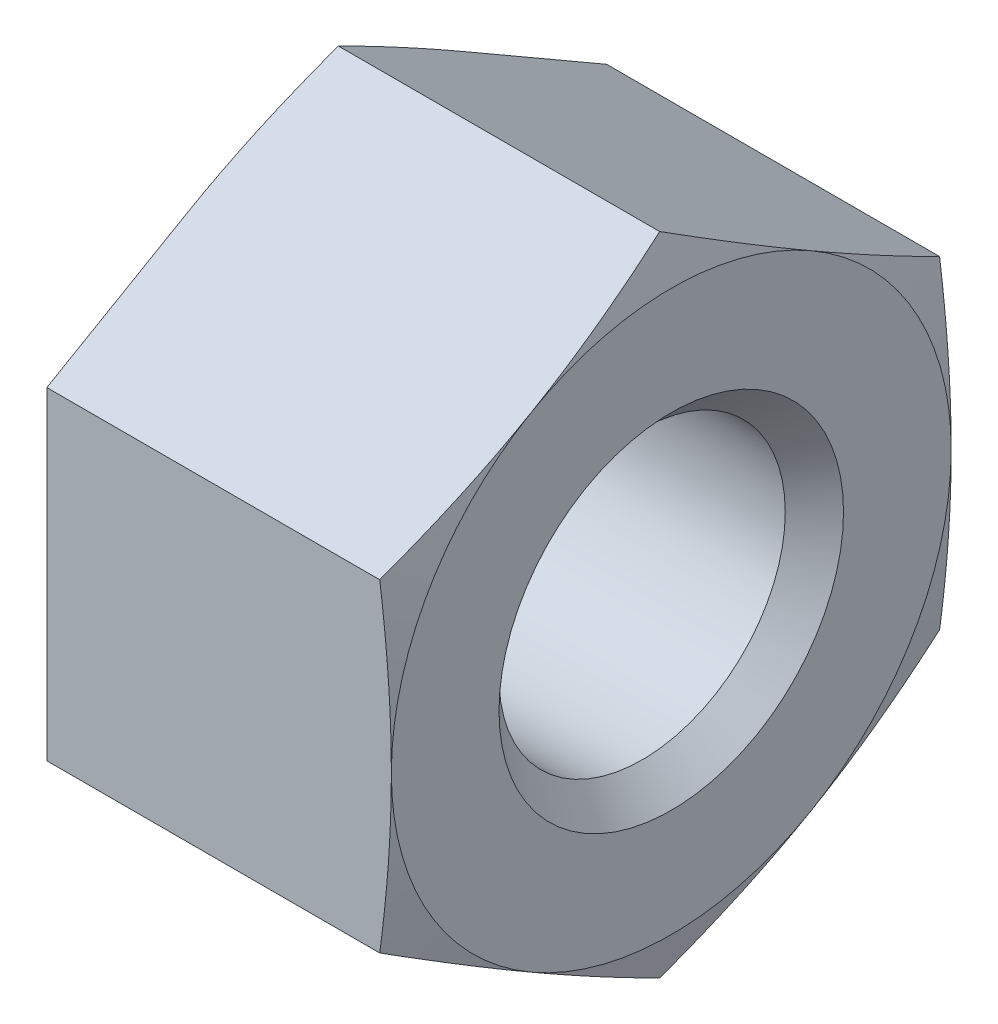
ISO-10303-21;
HEADER;
FILE_DESCRIPTION(('STEP AP214'),'2;1');
FILE_NAME('part.step','',(''),(''),'','','');
FILE_SCHEMA(('AUTOMOTIVE_DESIGN { 1 0 10303 214 1 1 1 1 }'));
ENDSEC;
DATA;
#1=APPLICATION_CONTEXT('core data for automotive mechanical design processes');
#2=APPLICATION_PROTOCOL_DEFINITION('international standard','automotive_design',2000,#1);
#3=PRODUCT_CONTEXT('',#1,'mechanical');
#4=PRODUCT('Part','Part','',(#3));
#5=PRODUCT_RELATED_PRODUCT_CATEGORY('part','',(#4));
#6=PRODUCT_DEFINITION_FORMATION('','',#4);
#7=PRODUCT_DEFINITION_CONTEXT('part definition',#1,'design');
#8=PRODUCT_DEFINITION('design','',#6,#7);
#9=PRODUCT_DEFINITION_SHAPE('','',#8);
#10=(LENGTH_UNIT() NAMED_UNIT(*) SI_UNIT(.MILLI.,.METRE.));
#11=(NAMED_UNIT(*) PLANE_ANGLE_UNIT() SI_UNIT($,.RADIAN.));
#12=(NAMED_UNIT(*) SI_UNIT($,.STERADIAN.) SOLID_ANGLE_UNIT());
#13=UNCERTAINTY_MEASURE_WITH_UNIT(LENGTH_MEASURE(1.E-05),#10,'distance_accuracy_value','');
#14=(GEOMETRIC_REPRESENTATION_CONTEXT(3) GLOBAL_UNCERTAINTY_ASSIGNED_CONTEXT((#13)) GLOBAL_UNIT_ASSIGNED_CONTEXT((#10,
#11,#12)) REPRESENTATION_CONTEXT('',''));
#15=CARTESIAN_POINT('',(0.,0.,0.));
#16=DIRECTION('',(0.,0.,1.));
#17=DIRECTION('',(1.,0.,0.));
#18=AXIS2_PLACEMENT_3D('',#15,#16,#17);
#19=CARTESIAN_POINT('',(0.,5.25,0.));
#20=DIRECTION('',(-1.,0.,0.));
#21=DIRECTION('',(0.,-1.,0.));
#22=AXIS2_PLACEMENT_3D('',#19,#20,#21);
#23=PLANE('',#22);
#24=CARTESIAN_POINT('',(0.,0.,0.));
#25=DIRECTION('',(-1.,0.,0.));
#26=DIRECTION('',(0.,-1.,0.));
#27=AXIS2_PLACEMENT_3D('',#24,#25,#26);
#28=CIRCLE('',#27,3.99999999994044);
#29=CARTESIAN_POINT('',(0.,-3.99999999994044,0.));
#30=VERTEX_POINT('',#29);
#31=EDGE_CURVE('E652',#30,#30,#28,.F.);
#32=ORIENTED_EDGE('',*,*,#31,.T.);
#33=EDGE_LOOP('',(#32));
#34=FACE_BOUND('',#33,.T.);
#35=CARTESIAN_POINT('',(0.,0.,0.));
#36=DIRECTION('',(1.,0.,0.));
#37=DIRECTION('',(0.,1.,0.));
#38=AXIS2_PLACEMENT_3D('',#35,#36,#37);
#39=CIRCLE('',#38,6.5);
#40=CARTESIAN_POINT('',(0.,-5.62916512459885,-3.25));
#41=VERTEX_POINT('',#40);
#42=CARTESIAN_POINT('',(0.,0.,-6.5));
#43=VERTEX_POINT('',#42);
#44=EDGE_CURVE('E382',#41,#43,#39,.T.);
#45=ORIENTED_EDGE('',*,*,#44,.F.);
#46=DIRECTION('',(0.,-0.5,0.866025403784439));
#47=VECTOR('',#46,1.);
#48=CARTESIAN_POINT('',(0.,-3.75277674973257,-6.5));
#49=LINE('',#48,#47);
#50=CARTESIAN_POINT('',(0.,-7.50555349946514,0.));
#51=VERTEX_POINT('',#50);
#52=EDGE_CURVE('E650',#41,#51,#49,.T.);
#53=ORIENTED_EDGE('',*,*,#52,.T.);
#54=DIRECTION('',(0.,0.5,0.866025403784439));
#55=VECTOR('',#54,1.);
#56=CARTESIAN_POINT('',(0.,-7.50555349946513,0.));
#57=LINE('',#56,#55);
#58=CARTESIAN_POINT('',(0.,-3.75277674973257,6.5));
#59=VERTEX_POINT('',#58);
#60=EDGE_CURVE('E61',#51,#59,#57,.T.);
#61=ORIENTED_EDGE('',*,*,#60,.T.);
#62=DIRECTION('',(0.,1.,0.));
#63=VECTOR('',#62,1.);
#64=CARTESIAN_POINT('',(0.,-3.75277674973257,6.5));
#65=LINE('',#64,#63);
#66=CARTESIAN_POINT('',(0.,3.75277674973257,6.5));
#67=VERTEX_POINT('',#66);
#68=EDGE_CURVE('E318',#59,#67,#65,.T.);
#69=ORIENTED_EDGE('',*,*,#68,.T.);
#70=DIRECTION('',(0.,-0.5,0.866025403784439));
#71=VECTOR('',#70,1.);
#72=CARTESIAN_POINT('',(0.,6.94166512459885,0.976683315065849));
#73=LINE('',#72,#71);
#74=CARTESIAN_POINT('',(0.,5.62916512459885,3.25));
#75=VERTEX_POINT('',#74);
#76=EDGE_CURVE('E643',#75,#67,#73,.T.);
#77=ORIENTED_EDGE('',*,*,#76,.F.);
#78=CARTESIAN_POINT('',(0.,0.,0.));
#79=DIRECTION('',(1.,0.,0.));
#80=DIRECTION('',(0.,1.,0.));
#81=AXIS2_PLACEMENT_3D('',#78,#79,#80);
#82=CIRCLE('',#81,6.5);
#83=CARTESIAN_POINT('',(0.,5.62916512459885,-3.25));
#84=VERTEX_POINT('',#83);
#85=EDGE_CURVE('E387',#84,#75,#82,.T.);
#86=ORIENTED_EDGE('',*,*,#85,.F.);
#87=DIRECTION('',(0.,-0.5,-0.866025403784439));
#88=VECTOR('',#87,1.);
#89=CARTESIAN_POINT('',(0.,7.50555349946513,0.));
#90=LINE('',#89,#88);
#91=CARTESIAN_POINT('',(0.,3.75277674973257,-6.5));
#92=VERTEX_POINT('',#91);
#93=EDGE_CURVE('E637',#84,#92,#90,.T.);
#94=ORIENTED_EDGE('',*,*,#93,.T.);
#95=DIRECTION('',(0.,1.,0.));
#96=VECTOR('',#95,1.);
#97=CARTESIAN_POINT('',(0.,5.25,-6.5));
#98=LINE('',#97,#96);
#99=EDGE_CURVE('E135',#43,#92,#98,.T.);
#100=ORIENTED_EDGE('',*,*,#99,.F.);
#101=EDGE_LOOP('',(#45,#53,#61,#69,#77,#86,#94,#100));
#102=FACE_BOUND('',#101,.T.);
#103=ADVANCED_FACE('F46',(#34,#102),#23,.T.);
#104=CARTESIAN_POINT('',(0.271053871616739,0.,0.));
#105=DIRECTION('',(1.,0.,0.));
#106=DIRECTION('',(0.,1.,0.));
#107=AXIS2_PLACEMENT_3D('',#104,#105,#106);
#108=CONICAL_SURFACE('',#107,7.51158682046192,1.30899693899575);
#109=ORIENTED_EDGE('',*,*,#44,.T.);
#110=CARTESIAN_POINT('',(0.,0.,-6.5));
#111=CARTESIAN_POINT('',(-7.13979565578263E-06,-0.157002105596348,-6.5));
#112=CARTESIAN_POINT('',(0.00152486973365407,-0.31399978962663,-6.5));
#113=CARTESIAN_POINT('',(0.00760677423425841,-0.627931829437165,-6.5));
#114=CARTESIAN_POINT('',(0.0121565721115602,-0.784866187092334,-6.5));
#115=CARTESIAN_POINT('',(0.0302281250175524,-1.2551418189265,-6.5));
#116=CARTESIAN_POINT('',(0.0481723122569531,-1.56832203806185,-6.5));
#117=CARTESIAN_POINT('',(0.094756857160038,-2.19378211713768,-6.5));
#118=CARTESIAN_POINT('',(0.123394692466353,-2.50606217191345,-6.5));
#119=CARTESIAN_POINT('',(0.189882514217087,-3.1300072751411,-6.5));
#120=CARTESIAN_POINT('',(0.227742957297204,-3.44167121780682,-6.5));
#121=CARTESIAN_POINT('',(0.269437248127971,-3.75277674973257,-6.5));
#122=B_SPLINE_CURVE_WITH_KNOTS('',3,(#110,#111,#112,#113,#114,#115,#116,#117,#118,#119,#120,
#121),.UNSPECIFIED.,.F.,.F.,(4,2,2,2,2,4),(0.,0.470990466283024,0.941965779705234,
1.88281797607381,2.82344838957464,3.76515029917374),.UNSPECIFIED.);
#123=CARTESIAN_POINT('',(0.269437248127971,-3.75277674973257,-6.5));
#124=VERTEX_POINT('',#123);
#125=EDGE_CURVE('E140',#43,#124,#122,.T.);
#126=ORIENTED_EDGE('',*,*,#125,.T.);
#127=CARTESIAN_POINT('',(0.269437248127971,-3.75277674973257,-6.5));
#128=CARTESIAN_POINT('',(0.227742957297204,-3.90832951569544,-6.23057470609444));
#129=CARTESIAN_POINT('',(0.189882514217087,-4.0641614870283,-5.9606658143023));
#130=CARTESIAN_POINT('',(0.123394692466353,-4.37613403864213,-5.42031350434025));
#131=CARTESIAN_POINT('',(0.0947568571600377,-4.53227406603001,-5.14987104380924));
#132=CARTESIAN_POINT('',(0.0481723122569529,-4.84500410556793,-4.60820672627655));
#133=CARTESIAN_POINT('',(0.0302281250175522,-5.0015942151356,-4.33698470054256));
#134=CARTESIAN_POINT('',(0.0121565721115598,-5.23673203105269,-3.92971405659339));
#135=CARTESIAN_POINT('',(0.00760677423425789,-5.31519920988027,-3.79380491613742));
#136=CARTESIAN_POINT('',(0.0015248697336535,-5.47216522978554,-3.52193179459963));
#137=CARTESIAN_POINT('',(-7.13979565629992E-06,-5.55066407180068,-3.38596781189408));
#138=CARTESIAN_POINT('',(0.,-5.62916512459885,-3.25));
#139=B_SPLINE_CURVE_WITH_KNOTS('',3,(#127,#128,#129,#130,#131,#132,#133,#134,#135,#136,#137,
#138),.UNSPECIFIED.,.F.,.F.,(4,2,2,2,2,4),(0.,0.941701909599103,1.88233232309993,
2.82318451946851,3.29415983289072,3.76515029917374),.UNSPECIFIED.);
#140=EDGE_CURVE('E250',#124,#41,#139,.T.);
#141=ORIENTED_EDGE('',*,*,#140,.T.);
#142=EDGE_LOOP('',(#109,#126,#141));
#143=FACE_BOUND('',#142,.T.);
#144=ADVANCED_FACE('F278',(#143),#108,.T.);
#145=CARTESIAN_POINT('',(0.271053871616739,0.,0.));
#146=DIRECTION('',(1.,0.,0.));
#147=DIRECTION('',(0.,1.,0.));
#148=AXIS2_PLACEMENT_3D('',#145,#146,#147);
#149=CONICAL_SURFACE('',#148,7.51158682046193,1.30899693899575);
#150=CARTESIAN_POINT('',(0.269437248127972,7.50555349946513,0.));
#151=CARTESIAN_POINT('',(0.227742957297205,7.35000073350226,-0.269425293905566));
#152=CARTESIAN_POINT('',(0.189882514217088,7.1941687621694,-0.539334185697703));
#153=CARTESIAN_POINT('',(0.123394692466353,6.88219621055557,-1.07968649565975));
#154=CARTESIAN_POINT('',(0.094756857160038,6.72605618316769,-1.35012895619077));
#155=CARTESIAN_POINT('',(0.0481723122569529,6.41332614362978,-1.89179327372345));
#156=CARTESIAN_POINT('',(0.0302281250175521,6.2567360340621,-2.16301529945744));
#157=CARTESIAN_POINT('',(0.0121565721115598,6.02159821814502,-2.57028594340661));
#158=CARTESIAN_POINT('',(0.00760677423425809,5.94313103931743,-2.70619508386258));
#159=CARTESIAN_POINT('',(0.00152486973365381,5.78616501941216,-2.97806820540037));
#160=CARTESIAN_POINT('',(-7.13979565599147E-06,5.70766617739702,-3.11403218810592));
#161=CARTESIAN_POINT('',(0.,5.62916512459885,-3.25));
#162=B_SPLINE_CURVE_WITH_KNOTS('',3,(#150,#151,#152,#153,#154,#155,#156,#157,#158,#159,#160,
#161),.UNSPECIFIED.,.F.,.F.,(4,2,2,2,2,4),(0.,0.941701909599103,1.88233232309993,
2.82318451946851,3.29415983289072,3.76515029917374),.UNSPECIFIED.);
#163=CARTESIAN_POINT('',(0.269437248127972,7.50555349946514,0.));
#164=VERTEX_POINT('',#163);
#165=EDGE_CURVE('E402',#164,#84,#162,.T.);
#166=ORIENTED_EDGE('',*,*,#165,.T.);
#167=ORIENTED_EDGE('',*,*,#85,.T.);
#168=CARTESIAN_POINT('',(0.,5.62916512459885,3.25));
#169=CARTESIAN_POINT('',(-7.13979565564765E-06,5.70766617739702,3.11403218810592));
#170=CARTESIAN_POINT('',(0.00152486973365415,5.78616501941217,2.97806820540037));
#171=CARTESIAN_POINT('',(0.00760677423425843,5.94313103931743,2.70619508386258));
#172=CARTESIAN_POINT('',(0.0121565721115602,6.02159821814502,2.57028594340661));
#173=CARTESIAN_POINT('',(0.0302281250175525,6.2567360340621,2.16301529945744));
#174=CARTESIAN_POINT('',(0.0481723122569534,6.41332614362978,1.89179327372345));
#175=CARTESIAN_POINT('',(0.0947568571600384,6.72605618316769,1.35012895619076));
#176=CARTESIAN_POINT('',(0.123394692466353,6.88219621055557,1.07968649565975));
#177=CARTESIAN_POINT('',(0.189882514217088,7.1941687621694,0.539334185697702));
#178=CARTESIAN_POINT('',(0.227742957297205,7.35000073350226,0.269425293905565));
#179=CARTESIAN_POINT('',(0.269437248127972,7.50555349946514,0.));
#180=B_SPLINE_CURVE_WITH_KNOTS('',3,(#168,#169,#170,#171,#172,#173,#174,#175,#176,#177,#178,
#179),.UNSPECIFIED.,.F.,.F.,(4,2,2,2,2,4),(0.,0.470990466283024,0.941965779705235,
1.88281797607382,2.82344838957464,3.76515029917374),.UNSPECIFIED.);
#181=EDGE_CURVE('E269',#75,#164,#180,.T.);
#182=ORIENTED_EDGE('',*,*,#181,.T.);
#183=EDGE_LOOP('',(#166,#167,#182));
#184=FACE_BOUND('',#183,.T.);
#185=ADVANCED_FACE('F282',(#184),#149,.T.);
#186=CARTESIAN_POINT('',(9.,3.75277674973257,6.5));
#187=DIRECTION('',(0.,-0.866025403784439,-0.5));
#188=DIRECTION('',(0.,0.5,-0.866025403784439));
#189=AXIS2_PLACEMENT_3D('',#186,#187,#188);
#190=PLANE('',#189);
#191=DIRECTION('',(-1.,0.,0.));
#192=VECTOR('',#191,1.);
#193=CARTESIAN_POINT('',(9.,3.75277674973257,6.5));
#194=LINE('',#193,#192);
#195=CARTESIAN_POINT('',(7.73056274880662,3.75277677261311,6.5));
#196=VERTEX_POINT('',#195);
#197=EDGE_CURVE('E461',#67,#196,#194,.F.);
#198=ORIENTED_EDGE('',*,*,#197,.T.);
#199=CARTESIAN_POINT('',(8.,5.62916512459885,3.25));
#200=CARTESIAN_POINT('',(8.00000713979493,5.55066407383612,3.38596780836859));
#201=CARTESIAN_POINT('',(7.99847513034546,5.47216523385625,3.52193178754894));
#202=CARTESIAN_POINT('',(7.99239322615947,5.31519921801895,3.79380490204081));
#203=CARTESIAN_POINT('',(7.98784342851693,5.23673204122406,3.92971403897604));
#204=CARTESIAN_POINT('',(7.96977187653705,5.00159423138714,4.33698467239407));
#205=CARTESIAN_POINT('',(7.95182769021088,4.84500412586075,4.60820669112834));
#206=CARTESIAN_POINT('',(7.90524314761743,4.53227409437238,5.14987099471882));
#207=CARTESIAN_POINT('',(7.87660531370721,4.37613407099275,5.42031344830733));
#208=CARTESIAN_POINT('',(7.81011749510641,4.06416152737775,5.96066574441501));
#209=CARTESIAN_POINT('',(7.77225705378095,3.90832956003539,6.23057462929539));
#210=CARTESIAN_POINT('',(7.73056276481819,3.75277679804829,6.49999991631471));
#211=B_SPLINE_CURVE_WITH_KNOTS('',3,(#199,#200,#201,#202,#203,#204,#205,#206,#207,#208,#209,
#210),.UNSPECIFIED.,.F.,.F.,(4,2,2,2,2,4),(0.,0.470990454071578,0.941965755284311,
1.88281792730448,2.82344831648137,3.76515020168719),.UNSPECIFIED.);
#212=CARTESIAN_POINT('',(8.,5.62916512459885,3.25));
#213=VERTEX_POINT('',#212);
#214=EDGE_CURVE('E340',#213,#196,#211,.T.);
#215=ORIENTED_EDGE('',*,*,#214,.F.);
#216=CARTESIAN_POINT('',(7.73056274574151,7.50555352234456,-3.96283249653615E-08));
#217=CARTESIAN_POINT('',(7.77225703745685,7.350000754499,0.269425257538153));
#218=CARTESIAN_POINT('',(7.81011748136786,7.19416878127647,0.539334152603284));
#219=CARTESIAN_POINT('',(7.87660530461022,6.88219622587488,1.07968646912593));
#220=CARTESIAN_POINT('',(7.90524314057764,6.72605619658893,1.35012893294449));
#221=CARTESIAN_POINT('',(7.95182768657443,6.41332615323924,1.89179325707937));
#222=CARTESIAN_POINT('',(7.96977187424628,6.25673604175786,2.16301528612801));
#223=CARTESIAN_POINT('',(7.98784342759083,6.02159822296157,2.57028593506409));
#224=CARTESIAN_POINT('',(7.9923932255793,5.94313104317142,2.70619507718727));
#225=CARTESIAN_POINT('',(7.99847513022888,5.78616502133981,2.97806820206159));
#226=CARTESIAN_POINT('',(8.000007139796,5.70766617836089,3.11403218643645));
#227=CARTESIAN_POINT('',(8.,5.62916512459885,3.25));
#228=B_SPLINE_CURVE_WITH_KNOTS('',3,(#216,#217,#218,#219,#220,#221,#222,#223,#224,#225,#226,
#227),.UNSPECIFIED.,.F.,.F.,(4,2,2,2,2,4),(0.,0.941701921150293,1.88233234616947,2.823184554068,
3.29415987327188,3.76515034533751),.UNSPECIFIED.);
#229=CARTESIAN_POINT('',(7.73056274880677,7.50555351090485,-1.98141624286739E-08));
#230=VERTEX_POINT('',#229);
#231=EDGE_CURVE('E336',#230,#213,#228,.T.);
#232=ORIENTED_EDGE('',*,*,#231,.F.);
#233=DIRECTION('',(1.,0.,0.));
#234=VECTOR('',#233,1.);
#235=CARTESIAN_POINT('',(9.,7.50555349946513,0.));
#236=LINE('',#235,#234);
#237=EDGE_CURVE('E139',#230,#164,#236,.F.);
#238=ORIENTED_EDGE('',*,*,#237,.T.);
#239=ORIENTED_EDGE('',*,*,#181,.F.);
#240=ORIENTED_EDGE('',*,*,#76,.T.);
#241=EDGE_LOOP('',(#198,#215,#232,#238,#239,#240));
#242=FACE_BOUND('',#241,.T.);
#243=ADVANCED_FACE('F439',(#242),#190,.F.);
#244=CARTESIAN_POINT('',(9.,-3.75277674973257,6.5));
#245=DIRECTION('',(0.,0.,-1.));
#246=DIRECTION('',(-1.,0.,0.));
#247=AXIS2_PLACEMENT_3D('',#244,#245,#246);
#248=PLANE('',#247);
#249=DIRECTION('',(1.,0.,0.));
#250=VECTOR('',#249,1.);
#251=CARTESIAN_POINT('',(9.,-3.75277674973257,6.5));
#252=LINE('',#251,#250);
#253=CARTESIAN_POINT('',(7.7305627583451,-3.75277677389042,6.49999995815736));
#254=VERTEX_POINT('',#253);
#255=EDGE_CURVE('E66',#59,#254,#252,.T.);
#256=ORIENTED_EDGE('',*,*,#255,.T.);
#257=CARTESIAN_POINT('',(8.,0.,6.5));
#258=CARTESIAN_POINT('',(8.000007139796,-0.157002107524173,6.5));
#259=CARTESIAN_POINT('',(7.99847513022888,-0.313999793482112,6.5));
#260=CARTESIAN_POINT('',(7.99239322557928,-0.627931837145524,6.5));
#261=CARTESIAN_POINT('',(7.98784342759081,-0.784866196725914,6.5));
#262=CARTESIAN_POINT('',(7.96977187424624,-1.25514183431876,6.5));
#263=CARTESIAN_POINT('',(7.95182768657438,-1.56832205728172,6.5));
#264=CARTESIAN_POINT('',(7.90524314057753,-2.19378214398147,6.5));
#265=CARTESIAN_POINT('',(7.87660530461008,-2.50606220255356,6.5));
#266=CARTESIAN_POINT('',(7.81011748136765,-3.1300073133571,6.5));
#267=CARTESIAN_POINT('',(7.77225703745659,-3.44167125980234,6.5));
#268=CARTESIAN_POINT('',(7.7305627457412,-3.75277679549365,6.5));
#269=B_SPLINE_CURVE_WITH_KNOTS('',3,(#257,#258,#259,#260,#261,#262,#263,#264,#265,#266,#267,
#268),.UNSPECIFIED.,.F.,.F.,(4,2,2,2,2,4),(0.,0.470990472065913,0.94196579127008,
1.88281799916917,2.82344842418891,3.76515034533976),.UNSPECIFIED.);
#270=CARTESIAN_POINT('',(8.,0.,6.5));
#271=VERTEX_POINT('',#270);
#272=EDGE_CURVE('E233',#271,#254,#269,.T.);
#273=ORIENTED_EDGE('',*,*,#272,.F.);
#274=CARTESIAN_POINT('',(7.7305627457412,3.75277679549366,6.5));
#275=CARTESIAN_POINT('',(7.77225703745659,3.44167125980235,6.5));
#276=CARTESIAN_POINT('',(7.81011748136765,3.13000731335711,6.5));
#277=CARTESIAN_POINT('',(7.87660530461008,2.50606220255357,6.5));
#278=CARTESIAN_POINT('',(7.90524314057753,2.19378214398147,6.5));
#279=CARTESIAN_POINT('',(7.95182768657437,1.56832205728172,6.5));
#280=CARTESIAN_POINT('',(7.96977187424624,1.25514183431876,6.5));
#281=CARTESIAN_POINT('',(7.98784342759081,0.784866196725916,6.5));
#282=CARTESIAN_POINT('',(7.99239322557929,0.627931837145525,6.5));
#283=CARTESIAN_POINT('',(7.99847513022888,0.313999793482112,6.5));
#284=CARTESIAN_POINT('',(8.000007139796,0.157002107524173,6.5));
#285=CARTESIAN_POINT('',(8.,0.,6.5));
#286=B_SPLINE_CURVE_WITH_KNOTS('',3,(#274,#275,#276,#277,#278,#279,#280,#281,#282,#283,#284,
#285),.UNSPECIFIED.,.F.,.F.,(4,2,2,2,2,4),(0.,0.941701921150859,1.8823323461706,
2.82318455406969,3.29415987327386,3.76515034533978),.UNSPECIFIED.);
#287=EDGE_CURVE('E347',#196,#271,#286,.T.);
#288=ORIENTED_EDGE('',*,*,#287,.F.);
#289=ORIENTED_EDGE('',*,*,#197,.F.);
#290=ORIENTED_EDGE('',*,*,#68,.F.);
#291=EDGE_LOOP('',(#256,#273,#288,#289,#290));
#292=FACE_BOUND('',#291,.T.);
#293=ADVANCED_FACE('F442',(#292),#248,.F.);
#294=CARTESIAN_POINT('',(9.,-7.50555349946513,0.));
#295=DIRECTION('',(0.,0.866025403784439,-0.5));
#296=DIRECTION('',(0.,0.5,0.866025403784439));
#297=AXIS2_PLACEMENT_3D('',#294,#295,#296);
#298=PLANE('',#297);
#299=DIRECTION('',(1.,0.,0.));
#300=VECTOR('',#299,1.);
#301=CARTESIAN_POINT('',(9.,-7.50555349946514,0.));
#302=LINE('',#301,#300);
#303=CARTESIAN_POINT('',(7.73056275357586,-7.50555349310634,-1.10137529284157E-08));
#304=VERTEX_POINT('',#303);
#305=EDGE_CURVE('E262',#51,#304,#302,.T.);
#306=ORIENTED_EDGE('',*,*,#305,.T.);
#307=CARTESIAN_POINT('',(8.,-5.62916512459885,3.25));
#308=CARTESIAN_POINT('',(8.00000713979546,-5.70766617686126,3.11403218903389));
#309=CARTESIAN_POINT('',(7.99847513028717,-5.78616501834068,2.97806820725624));
#310=CARTESIAN_POINT('',(7.99239322586938,-5.94313103717518,2.70619508757306));
#311=CARTESIAN_POINT('',(7.98784342805387,-6.02159821546772,2.57028594804382));
#312=CARTESIAN_POINT('',(7.96977187539165,-6.2567360297844,2.16301530686664));
#313=CARTESIAN_POINT('',(7.95182768839262,-6.41332613828833,1.8917932829751));
#314=CARTESIAN_POINT('',(7.90524314409748,-6.72605617570746,1.35012896911226));
#315=CARTESIAN_POINT('',(7.87660530915864,-6.8821962020403,1.07968651040864));
#316=CARTESIAN_POINT('',(7.81011748823703,-7.19416875154868,0.539334204093319));
#317=CARTESIAN_POINT('',(7.77225704561877,-7.35000072183117,0.269425314120484));
#318=CARTESIAN_POINT('',(7.73056275527969,-7.50555348674755,2.20275055806718E-08));
#319=B_SPLINE_CURVE_WITH_KNOTS('',3,(#307,#308,#309,#310,#311,#312,#313,#314,#315,#316,#317,
#318),.UNSPECIFIED.,.F.,.F.,(4,2,2,2,2,4),(0.,0.470990463068747,0.941965773277198,
1.88281796323683,2.82344837033515,3.76515027351349),.UNSPECIFIED.);
#320=CARTESIAN_POINT('',(8.,-5.62916512459885,3.25));
#321=VERTEX_POINT('',#320);
#322=EDGE_CURVE('E211',#321,#304,#319,.T.);
#323=ORIENTED_EDGE('',*,*,#322,.F.);
#324=CARTESIAN_POINT('',(7.73056276481818,-3.75277679804828,6.49999991631472));
#325=CARTESIAN_POINT('',(7.77225705378095,-3.90832956003538,6.2305746292954));
#326=CARTESIAN_POINT('',(7.81011749510641,-4.06416152737774,5.96066574441503));
#327=CARTESIAN_POINT('',(7.87660531370721,-4.37613407099274,5.42031344830734));
#328=CARTESIAN_POINT('',(7.90524314761743,-4.53227409437237,5.14987099471883));
#329=CARTESIAN_POINT('',(7.95182769021087,-4.84500412586075,4.60820669112835));
#330=CARTESIAN_POINT('',(7.96977187653705,-5.00159423138713,4.33698467239408));
#331=CARTESIAN_POINT('',(7.98784342851693,-5.23673204122406,3.92971403897604));
#332=CARTESIAN_POINT('',(7.99239322615947,-5.31519921801895,3.79380490204081));
#333=CARTESIAN_POINT('',(7.99847513034546,-5.47216523385625,3.52193178754894));
#334=CARTESIAN_POINT('',(8.00000713979493,-5.55066407383613,3.38596780836858));
#335=CARTESIAN_POINT('',(8.,-5.62916512459885,3.25));
#336=B_SPLINE_CURVE_WITH_KNOTS('',3,(#324,#325,#326,#327,#328,#329,#330,#331,#332,#333,#334,
#335),.UNSPECIFIED.,.F.,.F.,(4,2,2,2,2,4),(0.,0.941701885205831,1.88233227438272,
2.8231844464029,3.29415974761563,3.76515020168721),.UNSPECIFIED.);
#337=EDGE_CURVE('E351',#254,#321,#336,.T.);
#338=ORIENTED_EDGE('',*,*,#337,.F.);
#339=ORIENTED_EDGE('',*,*,#255,.F.);
#340=ORIENTED_EDGE('',*,*,#60,.F.);
#341=EDGE_LOOP('',(#306,#323,#338,#339,#340));
#342=FACE_BOUND('',#341,.T.);
#343=ADVANCED_FACE('F244',(#342),#298,.F.);
#344=CARTESIAN_POINT('',(9.,-3.75277674973257,-6.5));
#345=DIRECTION('',(0.,0.866025403784439,0.5));
#346=DIRECTION('',(0.,-0.5,0.866025403784439));
#347=AXIS2_PLACEMENT_3D('',#344,#345,#346);
#348=PLANE('',#347);
#349=ORIENTED_EDGE('',*,*,#140,.F.);
#350=DIRECTION('',(1.,0.,0.));
#351=VECTOR('',#350,1.);
#352=CARTESIAN_POINT('',(9.,-3.75277674973257,-6.5));
#353=LINE('',#352,#351);
#354=CARTESIAN_POINT('',(7.7305627583451,-3.75277670141685,-6.5));
#355=VERTEX_POINT('',#354);
#356=EDGE_CURVE('E261',#124,#355,#353,.T.);
#357=ORIENTED_EDGE('',*,*,#356,.T.);
#358=CARTESIAN_POINT('',(8.,-5.62916512459885,-3.25));
#359=CARTESIAN_POINT('',(8.000007139796,-5.55066407083677,-3.38596781356363));
#360=CARTESIAN_POINT('',(7.99847513022888,-5.4721652278578,-3.52193179793858));
#361=CARTESIAN_POINT('',(7.99239322557928,-5.31519920602609,-3.79380492281306));
#362=CARTESIAN_POINT('',(7.98784342759081,-5.23673202623589,-3.92971406493632));
#363=CARTESIAN_POINT('',(7.96977187424624,-5.00159420743947,-4.33698471387265));
#364=CARTESIAN_POINT('',(7.95182768657437,-4.84500409595799,-4.60820674292145));
#365=CARTESIAN_POINT('',(7.90524314057753,-4.53227405260812,-5.14987106705664));
#366=CARTESIAN_POINT('',(7.87660530461008,-4.37613402332207,-5.42031353087537));
#367=CARTESIAN_POINT('',(7.81011748136765,-4.0641614679203,-5.96066584739834));
#368=CARTESIAN_POINT('',(7.77225703745659,-3.90832949469768,-6.23057474246363));
#369=CARTESIAN_POINT('',(7.7305627457412,-3.75277672685202,-6.50000003963027));
#370=B_SPLINE_CURVE_WITH_KNOTS('',3,(#358,#359,#360,#361,#362,#363,#364,#365,#366,#367,#368,
#369),.UNSPECIFIED.,.F.,.F.,(4,2,2,2,2,4),(0.,0.470990472065914,0.941965791270083,
1.88281799916917,2.82344842418891,3.76515034533977),.UNSPECIFIED.);
#371=CARTESIAN_POINT('',(8.,-5.62916512459885,-3.25));
#372=VERTEX_POINT('',#371);
#373=EDGE_CURVE('E159',#372,#355,#370,.T.);
#374=ORIENTED_EDGE('',*,*,#373,.F.);
#375=CARTESIAN_POINT('',(7.73056275527969,-7.50555348674755,-2.20275066146416E-08));
#376=CARTESIAN_POINT('',(7.77225704561877,-7.35000072183117,-0.269425314120485));
#377=CARTESIAN_POINT('',(7.81011748823703,-7.19416875154869,-0.53933420409332));
#378=CARTESIAN_POINT('',(7.87660530915864,-6.8821962020403,-1.07968651040865));
#379=CARTESIAN_POINT('',(7.90524314409748,-6.72605617570746,-1.35012896911226));
#380=CARTESIAN_POINT('',(7.95182768839262,-6.41332613828833,-1.8917932829751));
#381=CARTESIAN_POINT('',(7.96977187539164,-6.2567360297844,-2.16301530686664));
#382=CARTESIAN_POINT('',(7.98784342805387,-6.02159821546772,-2.57028594804382));
#383=CARTESIAN_POINT('',(7.99239322586938,-5.94313103717518,-2.70619508757307));
#384=CARTESIAN_POINT('',(7.99847513028717,-5.78616501834068,-2.97806820725624));
#385=CARTESIAN_POINT('',(8.00000713979546,-5.70766617686126,-3.11403218903389));
#386=CARTESIAN_POINT('',(8.,-5.62916512459885,-3.25));
#387=B_SPLINE_CURVE_WITH_KNOTS('',3,(#375,#376,#377,#378,#379,#380,#381,#382,#383,#384,#385,
#386),.UNSPECIFIED.,.F.,.F.,(4,2,2,2,2,4),(0.,0.941701903178344,1.88233231027666,
2.82318450023629,3.29415981044474,3.76515027351349),.UNSPECIFIED.);
#388=EDGE_CURVE('E224',#304,#372,#387,.T.);
#389=ORIENTED_EDGE('',*,*,#388,.F.);
#390=ORIENTED_EDGE('',*,*,#305,.F.);
#391=ORIENTED_EDGE('',*,*,#52,.F.);
#392=EDGE_LOOP('',(#349,#357,#374,#389,#390,#391));
#393=FACE_BOUND('',#392,.T.);
#394=ADVANCED_FACE('F241',(#393),#348,.F.);
#395=CARTESIAN_POINT('',(9.,3.75277674973257,-6.5));
#396=DIRECTION('',(0.,0.,1.));
#397=DIRECTION('',(1.,0.,0.));
#398=AXIS2_PLACEMENT_3D('',#395,#396,#397);
#399=PLANE('',#398);
#400=ORIENTED_EDGE('',*,*,#125,.F.);
#401=ORIENTED_EDGE('',*,*,#99,.T.);
#402=DIRECTION('',(1.,0.,0.));
#403=VECTOR('',#402,1.);
#404=CARTESIAN_POINT('',(9.,3.75277674973257,-6.5));
#405=LINE('',#404,#403);
#406=CARTESIAN_POINT('',(7.73056274880662,3.75277673829229,-6.50000001981514));
#407=VERTEX_POINT('',#406);
#408=EDGE_CURVE('E127',#92,#407,#405,.T.);
#409=ORIENTED_EDGE('',*,*,#408,.T.);
#410=CARTESIAN_POINT('',(8.,0.,-6.5));
#411=CARTESIAN_POINT('',(8.00000713979493,0.157002101525453,-6.5));
#412=CARTESIAN_POINT('',(7.99847513034546,0.313999781485197,-6.5));
#413=CARTESIAN_POINT('',(7.99239322615947,0.627931813159798,-6.5));
#414=CARTESIAN_POINT('',(7.98784342851693,0.78486616674957,-6.5));
#415=CARTESIAN_POINT('',(7.96977187653705,1.25514178642343,-6.5));
#416=CARTESIAN_POINT('',(7.95182769021087,1.5683219974762,-6.5));
#417=CARTESIAN_POINT('',(7.90524314761743,2.19378206045295,-6.5));
#418=CARTESIAN_POINT('',(7.87660531370721,2.5060621072122,-6.5));
#419=CARTESIAN_POINT('',(7.81011749510641,3.13000719444221,-6.5));
#420=CARTESIAN_POINT('',(7.77225705378095,3.44167112912692,-6.5));
#421=CARTESIAN_POINT('',(7.73056276481819,3.75277665310111,-6.5));
#422=B_SPLINE_CURVE_WITH_KNOTS('',3,(#410,#411,#412,#413,#414,#415,#416,#417,#418,#419,#420,
#421),.UNSPECIFIED.,.F.,.F.,(4,2,2,2,2,4),(0.,0.470990454071578,0.941965755284312,
1.88281792730448,2.82344831648137,3.76515020168719),.UNSPECIFIED.);
#423=CARTESIAN_POINT('',(8.,0.,-6.5));
#424=VERTEX_POINT('',#423);
#425=EDGE_CURVE('E133',#424,#407,#422,.T.);
#426=ORIENTED_EDGE('',*,*,#425,.F.);
#427=CARTESIAN_POINT('',(7.73056276481819,-3.75277665310113,-6.5));
#428=CARTESIAN_POINT('',(7.77225705378095,-3.44167112912694,-6.5));
#429=CARTESIAN_POINT('',(7.81011749510641,-3.13000719444222,-6.5));
#430=CARTESIAN_POINT('',(7.87660531370721,-2.50606210721221,-6.5));
#431=CARTESIAN_POINT('',(7.90524314761743,-2.19378206045296,-6.5));
#432=CARTESIAN_POINT('',(7.95182769021087,-1.5683219974762,-6.5));
#433=CARTESIAN_POINT('',(7.96977187653705,-1.25514178642343,-6.5));
#434=CARTESIAN_POINT('',(7.98784342851693,-0.784866166749574,-6.5));
#435=CARTESIAN_POINT('',(7.99239322615947,-0.6279318131598,-6.5));
#436=CARTESIAN_POINT('',(7.99847513034546,-0.313999781485198,-6.5));
#437=CARTESIAN_POINT('',(8.00000713979493,-0.157002101525454,-6.5));
#438=CARTESIAN_POINT('',(8.,0.,-6.5));
#439=B_SPLINE_CURVE_WITH_KNOTS('',3,(#427,#428,#429,#430,#431,#432,#433,#434,#435,#436,#437,
#438),.UNSPECIFIED.,.F.,.F.,(4,2,2,2,2,4),(0.,0.941701885205829,1.88233227438272,
2.82318444640289,3.29415974761563,3.76515020168721),.UNSPECIFIED.);
#440=EDGE_CURVE('E164',#355,#424,#439,.T.);
#441=ORIENTED_EDGE('',*,*,#440,.F.);
#442=ORIENTED_EDGE('',*,*,#356,.F.);
#443=EDGE_LOOP('',(#400,#401,#409,#426,#441,#442));
#444=FACE_BOUND('',#443,.T.);
#445=ADVANCED_FACE('F130',(#444),#399,.F.);
#446=CARTESIAN_POINT('',(9.,7.50555349946513,0.));
#447=DIRECTION('',(0.,-0.866025403784439,0.5));
#448=DIRECTION('',(0.,-0.5,-0.866025403784439));
#449=AXIS2_PLACEMENT_3D('',#446,#447,#448);
#450=PLANE('',#449);
#451=ORIENTED_EDGE('',*,*,#165,.F.);
#452=ORIENTED_EDGE('',*,*,#237,.F.);
#453=CARTESIAN_POINT('',(8.,5.62916512459885,-3.25));
#454=CARTESIAN_POINT('',(8.00000713979493,5.70766617536162,-3.11403219163133));
#455=CARTESIAN_POINT('',(7.99847513034546,5.78616501534154,-2.97806821245089));
#456=CARTESIAN_POINT('',(7.99239322615946,5.94313103117894,-2.70619509795886));
#457=CARTESIAN_POINT('',(7.98784342851691,6.02159820797387,-2.57028596102355));
#458=CARTESIAN_POINT('',(7.96977187653701,6.25673601781094,-2.16301532760527));
#459=CARTESIAN_POINT('',(7.95182769021082,6.41332612333742,-1.89179330887084));
#460=CARTESIAN_POINT('',(7.90524314761732,6.72605615482599,-1.35012900528003));
#461=CARTESIAN_POINT('',(7.87660531370707,6.8821961782057,-1.07968655169137));
#462=CARTESIAN_POINT('',(7.81011749510619,7.1941687218209,-0.539334255583358));
#463=CARTESIAN_POINT('',(7.77225705378069,7.35000068916335,-0.269425370702821));
#464=CARTESIAN_POINT('',(7.73056276481789,7.50555345115054,-8.36833414721271E-08));
#465=B_SPLINE_CURVE_WITH_KNOTS('',3,(#453,#454,#455,#456,#457,#458,#459,#460,#461,#462,#463,
#464),.UNSPECIFIED.,.F.,.F.,(4,2,2,2,2,4),(0.,0.470990454071863,0.941965755284881,
1.88281792730562,2.82344831648307,3.76515020168947),.UNSPECIFIED.);
#466=CARTESIAN_POINT('',(8.,5.62916512459885,-3.25));
#467=VERTEX_POINT('',#466);
#468=EDGE_CURVE('E147',#467,#230,#465,.T.);
#469=ORIENTED_EDGE('',*,*,#468,.F.);
#470=CARTESIAN_POINT('',(7.7305627457412,3.75277672685202,-6.50000003963027));
#471=CARTESIAN_POINT('',(7.77225703745659,3.90832949469767,-6.23057474246363));
#472=CARTESIAN_POINT('',(7.81011748136765,4.06416146792029,-5.96066584739834));
#473=CARTESIAN_POINT('',(7.87660530461008,4.37613402332207,-5.42031353087537));
#474=CARTESIAN_POINT('',(7.90524314057753,4.53227405260811,-5.14987106705665));
#475=CARTESIAN_POINT('',(7.95182768657437,4.84500409595799,-4.60820674292145));
#476=CARTESIAN_POINT('',(7.96977187424624,5.00159420743947,-4.33698471387265));
#477=CARTESIAN_POINT('',(7.98784342759081,5.23673202623589,-3.92971406493632));
#478=CARTESIAN_POINT('',(7.99239322557929,5.31519920602609,-3.79380492281306));
#479=CARTESIAN_POINT('',(7.99847513022888,5.47216522785779,-3.52193179793858));
#480=CARTESIAN_POINT('',(8.000007139796,5.55066407083676,-3.38596781356363));
#481=CARTESIAN_POINT('',(8.,5.62916512459885,-3.25));
#482=B_SPLINE_CURVE_WITH_KNOTS('',3,(#470,#471,#472,#473,#474,#475,#476,#477,#478,#479,#480,
#481),.UNSPECIFIED.,.F.,.F.,(4,2,2,2,2,4),(0.,0.94170192115086,1.8823323461706,2.82318455406969,
3.29415987327386,3.76515034533978),.UNSPECIFIED.);
#483=EDGE_CURVE('E143',#407,#467,#482,.T.);
#484=ORIENTED_EDGE('',*,*,#483,.F.);
#485=ORIENTED_EDGE('',*,*,#408,.F.);
#486=ORIENTED_EDGE('',*,*,#93,.F.);
#487=EDGE_LOOP('',(#451,#452,#469,#484,#485,#486));
#488=FACE_BOUND('',#487,.T.);
#489=ADVANCED_FACE('F145',(#488),#450,.F.);
#490=CARTESIAN_POINT('',(7.72894612838326,0.,0.));
#491=DIRECTION('',(-1.,0.,0.));
#492=DIRECTION('',(0.,-1.,0.));
#493=AXIS2_PLACEMENT_3D('',#490,#491,#492);
#494=CONICAL_SURFACE('',#493,7.51158682046193,1.30899693899575);
#495=ORIENTED_EDGE('',*,*,#231,.T.);
#496=CARTESIAN_POINT('',(8.,0.,0.));
#497=DIRECTION('',(-1.,0.,0.));
#498=DIRECTION('',(0.,-1.,0.));
#499=AXIS2_PLACEMENT_3D('',#496,#497,#498);
#500=CIRCLE('',#499,6.5);
#501=EDGE_CURVE('E153',#467,#213,#500,.F.);
#502=ORIENTED_EDGE('',*,*,#501,.F.);
#503=ORIENTED_EDGE('',*,*,#468,.T.);
#504=EDGE_LOOP('',(#495,#502,#503));
#505=FACE_BOUND('',#504,.T.);
#506=ADVANCED_FACE('F334',(#505),#494,.T.);
#507=CARTESIAN_POINT('',(7.72894612838326,0.,0.));
#508=DIRECTION('',(-1.,0.,0.));
#509=DIRECTION('',(0.,0.,1.));
#510=AXIS2_PLACEMENT_3D('',#507,#508,#509);
#511=CONICAL_SURFACE('',#510,7.51158682046193,1.30899693899575);
#512=ORIENTED_EDGE('',*,*,#287,.T.);
#513=CARTESIAN_POINT('',(8.,0.,0.));
#514=DIRECTION('',(-1.,0.,0.));
#515=DIRECTION('',(0.,0.,1.));
#516=AXIS2_PLACEMENT_3D('',#513,#514,#515);
#517=CIRCLE('',#516,6.5);
#518=EDGE_CURVE('E326',#213,#271,#517,.F.);
#519=ORIENTED_EDGE('',*,*,#518,.F.);
#520=ORIENTED_EDGE('',*,*,#214,.T.);
#521=EDGE_LOOP('',(#512,#519,#520));
#522=FACE_BOUND('',#521,.T.);
#523=ADVANCED_FACE('F345',(#522),#511,.T.);
#524=CARTESIAN_POINT('',(7.72894612838326,0.,0.));
#525=DIRECTION('',(-1.,0.,0.));
#526=DIRECTION('',(0.,-1.,0.));
#527=AXIS2_PLACEMENT_3D('',#524,#525,#526);
#528=CONICAL_SURFACE('',#527,7.51158682046192,1.30899693899575);
#529=CARTESIAN_POINT('',(8.,0.,0.));
#530=DIRECTION('',(-1.,0.,0.));
#531=DIRECTION('',(0.,-1.,0.));
#532=AXIS2_PLACEMENT_3D('',#529,#530,#531);
#533=CIRCLE('',#532,6.5);
#534=EDGE_CURVE('E320',#271,#321,#533,.F.);
#535=ORIENTED_EDGE('',*,*,#534,.F.);
#536=ORIENTED_EDGE('',*,*,#272,.T.);
#537=ORIENTED_EDGE('',*,*,#337,.T.);
#538=EDGE_LOOP('',(#535,#536,#537));
#539=FACE_BOUND('',#538,.T.);
#540=ADVANCED_FACE('F356',(#539),#528,.T.);
#541=CARTESIAN_POINT('',(7.72894612838326,0.,0.));
#542=DIRECTION('',(-1.,0.,0.));
#543=DIRECTION('',(0.,-1.,0.));
#544=AXIS2_PLACEMENT_3D('',#541,#542,#543);
#545=CONICAL_SURFACE('',#544,7.51158682046192,1.30899693899575);
#546=CARTESIAN_POINT('',(8.,0.,0.));
#547=DIRECTION('',(-1.,0.,0.));
#548=DIRECTION('',(0.,-1.,0.));
#549=AXIS2_PLACEMENT_3D('',#546,#547,#548);
#550=CIRCLE('',#549,6.5);
#551=EDGE_CURVE('E312',#321,#372,#550,.F.);
#552=ORIENTED_EDGE('',*,*,#551,.F.);
#553=ORIENTED_EDGE('',*,*,#322,.T.);
#554=ORIENTED_EDGE('',*,*,#388,.T.);
#555=EDGE_LOOP('',(#552,#553,#554));
#556=FACE_BOUND('',#555,.T.);
#557=ADVANCED_FACE('F199',(#556),#545,.T.);
#558=CARTESIAN_POINT('',(7.72894612838326,0.,0.));
#559=DIRECTION('',(-1.,0.,0.));
#560=DIRECTION('',(0.,-1.,0.));
#561=AXIS2_PLACEMENT_3D('',#558,#559,#560);
#562=CONICAL_SURFACE('',#561,7.51158682046192,1.30899693899575);
#563=CARTESIAN_POINT('',(8.,0.,0.));
#564=DIRECTION('',(-1.,0.,0.));
#565=DIRECTION('',(0.,-1.,0.));
#566=AXIS2_PLACEMENT_3D('',#563,#564,#565);
#567=CIRCLE('',#566,6.5);
#568=EDGE_CURVE('E308',#372,#424,#567,.F.);
#569=ORIENTED_EDGE('',*,*,#568,.F.);
#570=ORIENTED_EDGE('',*,*,#373,.T.);
#571=ORIENTED_EDGE('',*,*,#440,.T.);
#572=EDGE_LOOP('',(#569,#570,#571));
#573=FACE_BOUND('',#572,.T.);
#574=ADVANCED_FACE('F193',(#573),#562,.T.);
#575=CARTESIAN_POINT('',(7.72894612838326,0.,0.));
#576=DIRECTION('',(-1.,0.,0.));
#577=DIRECTION('',(0.,0.,1.));
#578=AXIS2_PLACEMENT_3D('',#575,#576,#577);
#579=CONICAL_SURFACE('',#578,7.51158682046193,1.30899693899575);
#580=ORIENTED_EDGE('',*,*,#483,.T.);
#581=CARTESIAN_POINT('',(8.,0.,0.));
#582=DIRECTION('',(-1.,0.,0.));
#583=DIRECTION('',(0.,0.,1.));
#584=AXIS2_PLACEMENT_3D('',#581,#582,#583);
#585=CIRCLE('',#584,6.5);
#586=EDGE_CURVE('E156',#424,#467,#585,.F.);
#587=ORIENTED_EDGE('',*,*,#586,.F.);
#588=ORIENTED_EDGE('',*,*,#425,.T.);
#589=EDGE_LOOP('',(#580,#587,#588));
#590=FACE_BOUND('',#589,.T.);
#591=ADVANCED_FACE('F155',(#590),#579,.T.);
#592=CARTESIAN_POINT('',(8.,5.25,0.));
#593=DIRECTION('',(1.,0.,0.));
#594=DIRECTION('',(0.,0.,-1.));
#595=AXIS2_PLACEMENT_3D('',#592,#593,#594);
#596=PLANE('',#595);
#597=CARTESIAN_POINT('',(8.,0.,0.));
#598=DIRECTION('',(1.,0.,0.));
#599=DIRECTION('',(0.,0.,-1.));
#600=AXIS2_PLACEMENT_3D('',#597,#598,#599);
#601=CIRCLE('',#600,3.99999999994045);
#602=CARTESIAN_POINT('',(8.,0.,-3.99999999994045));
#603=VERTEX_POINT('',#602);
#604=EDGE_CURVE('E13',#603,#603,#601,.F.);
#605=ORIENTED_EDGE('',*,*,#604,.T.);
#606=EDGE_LOOP('',(#605));
#607=FACE_BOUND('',#606,.T.);
#608=ORIENTED_EDGE('',*,*,#568,.T.);
#609=ORIENTED_EDGE('',*,*,#586,.T.);
#610=ORIENTED_EDGE('',*,*,#501,.T.);
#611=ORIENTED_EDGE('',*,*,#518,.T.);
#612=ORIENTED_EDGE('',*,*,#534,.T.);
#613=ORIENTED_EDGE('',*,*,#551,.T.);
#614=EDGE_LOOP('',(#608,#609,#610,#611,#612,#613));
#615=FACE_BOUND('',#614,.T.);
#616=ADVANCED_FACE('F192',(#607,#615),#596,.T.);
#617=CARTESIAN_POINT('',(8.,0.,0.));
#618=DIRECTION('',(1.,0.,0.));
#619=DIRECTION('',(0.,0.,-1.));
#620=AXIS2_PLACEMENT_3D('',#617,#618,#619);
#621=CYLINDRICAL_SURFACE('',#620,3.32349999999999);
#622=CARTESIAN_POINT('',(0.676499999940457,0.,0.));
#623=DIRECTION('',(-1.,0.,0.));
#624=DIRECTION('',(0.,0.,1.));
#625=AXIS2_PLACEMENT_3D('',#622,#623,#624);
#626=CIRCLE('',#625,3.32349999999999);
#627=CARTESIAN_POINT('',(0.676499999940457,0.,3.32349999999999));
#628=VERTEX_POINT('',#627);
#629=EDGE_CURVE('E54',#628,#628,#626,.T.);
#630=ORIENTED_EDGE('',*,*,#629,.T.);
#631=EDGE_LOOP('',(#630));
#632=FACE_BOUND('',#631,.T.);
#633=CARTESIAN_POINT('',(7.32350000005954,0.,0.));
#634=DIRECTION('',(1.,0.,0.));
#635=DIRECTION('',(0.,0.,-1.));
#636=AXIS2_PLACEMENT_3D('',#633,#634,#635);
#637=CIRCLE('',#636,3.32349999999999);
#638=CARTESIAN_POINT('',(7.32350000005954,0.,-3.32349999999999));
#639=VERTEX_POINT('',#638);
#640=EDGE_CURVE('E658',#639,#639,#637,.T.);
#641=ORIENTED_EDGE('',*,*,#640,.T.);
#642=EDGE_LOOP('',(#641));
#643=FACE_BOUND('',#642,.T.);
#644=ADVANCED_FACE('F288',(#632,#643),#621,.F.);
#645=CARTESIAN_POINT('',(0.,0.,0.));
#646=DIRECTION('',(-1.,0.,0.));
#647=DIRECTION('',(0.,0.,1.));
#648=AXIS2_PLACEMENT_3D('',#645,#646,#647);
#649=CONICAL_SURFACE('',#648,3.99999999994044,0.785398163397445);
#650=ORIENTED_EDGE('',*,*,#629,.F.);
#651=EDGE_LOOP('',(#650));
#652=FACE_BOUND('',#651,.T.);
#653=ORIENTED_EDGE('',*,*,#31,.F.);
#654=EDGE_LOOP('',(#653));
#655=FACE_BOUND('',#654,.T.);
#656=ADVANCED_FACE('F289',(#652,#655),#649,.F.);
#657=CARTESIAN_POINT('',(7.32350000005954,0.,0.));
#658=DIRECTION('',(1.,0.,0.));
#659=DIRECTION('',(0.,0.,-1.));
#660=AXIS2_PLACEMENT_3D('',#657,#658,#659);
#661=CONICAL_SURFACE('',#660,3.32349999999999,0.78539816339745);
#662=ORIENTED_EDGE('',*,*,#604,.F.);
#663=EDGE_LOOP('',(#662));
#664=FACE_BOUND('',#663,.T.);
#665=ORIENTED_EDGE('',*,*,#640,.F.);
#666=EDGE_LOOP('',(#665));
#667=FACE_BOUND('',#666,.T.);
#668=ADVANCED_FACE('F48',(#664,#667),#661,.F.);
#669=CLOSED_SHELL('',(#103,#144,#185,#243,#293,#343,#394,#445,#489,#506,#523,#540,#557,#574,
#591,#616,#644,#656,#668));
#670=MANIFOLD_SOLID_BREP('B2',#669);
#671=ADVANCED_BREP_SHAPE_REPRESENTATION('',(#18,#670),#14);
#672=SHAPE_DEFINITION_REPRESENTATION(#9,#671);
ENDSEC;
END-ISO-10303-21;
